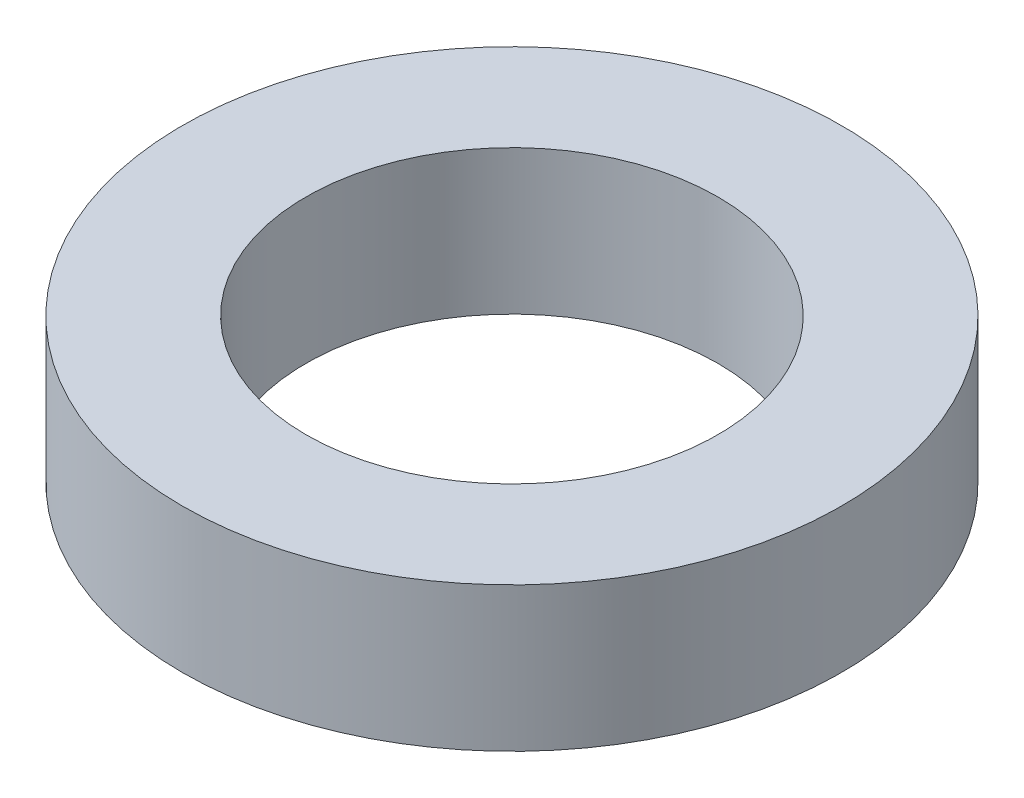
ISO-10303-21;
HEADER;
FILE_DESCRIPTION(('STEP AP214'),'2;1');
FILE_NAME('part.step','',(''),(''),'','','');
FILE_SCHEMA(('AUTOMOTIVE_DESIGN { 1 0 10303 214 1 1 1 1 }'));
ENDSEC;
DATA;
#1=APPLICATION_CONTEXT('core data for automotive mechanical design processes');
#2=APPLICATION_PROTOCOL_DEFINITION('international standard','automotive_design',2000,#1);
#3=PRODUCT_CONTEXT('',#1,'mechanical');
#4=PRODUCT('Part','Part','',(#3));
#5=PRODUCT_RELATED_PRODUCT_CATEGORY('part','',(#4));
#6=PRODUCT_DEFINITION_FORMATION('','',#4);
#7=PRODUCT_DEFINITION_CONTEXT('part definition',#1,'design');
#8=PRODUCT_DEFINITION('design','',#6,#7);
#9=PRODUCT_DEFINITION_SHAPE('','',#8);
#10=(LENGTH_UNIT() NAMED_UNIT(*) SI_UNIT(.MILLI.,.METRE.));
#11=(NAMED_UNIT(*) PLANE_ANGLE_UNIT() SI_UNIT($,.RADIAN.));
#12=(NAMED_UNIT(*) SI_UNIT($,.STERADIAN.) SOLID_ANGLE_UNIT());
#13=UNCERTAINTY_MEASURE_WITH_UNIT(LENGTH_MEASURE(1.E-05),#10,'distance_accuracy_value','');
#14=(GEOMETRIC_REPRESENTATION_CONTEXT(3) GLOBAL_UNCERTAINTY_ASSIGNED_CONTEXT((#13)) GLOBAL_UNIT_ASSIGNED_CONTEXT((#10,
#11,#12)) REPRESENTATION_CONTEXT('',''));
#15=CARTESIAN_POINT('',(0.,0.,0.));
#16=DIRECTION('',(0.,0.,1.));
#17=DIRECTION('',(1.,0.,0.));
#18=AXIS2_PLACEMENT_3D('',#15,#16,#17);
#19=CARTESIAN_POINT('',(0.,7.,0.));
#20=DIRECTION('',(0.,1.,0.));
#21=DIRECTION('',(0.,0.,1.));
#22=AXIS2_PLACEMENT_3D('',#19,#20,#21);
#23=PLANE('',#22);
#24=CARTESIAN_POINT('',(0.,7.,0.));
#25=DIRECTION('',(0.,1.,0.));
#26=DIRECTION('',(0.,0.,1.));
#27=AXIS2_PLACEMENT_3D('',#24,#25,#26);
#28=CIRCLE('',#27,16.);
#29=CARTESIAN_POINT('',(0.,7.,16.));
#30=VERTEX_POINT('',#29);
#31=EDGE_CURVE('E10',#30,#30,#28,.T.);
#32=ORIENTED_EDGE('',*,*,#31,.T.);
#33=EDGE_LOOP('',(#32));
#34=FACE_BOUND('',#33,.T.);
#35=CARTESIAN_POINT('',(0.,7.,0.));
#36=DIRECTION('',(0.,1.,0.));
#37=DIRECTION('',(0.,0.,1.));
#38=AXIS2_PLACEMENT_3D('',#35,#36,#37);
#39=CIRCLE('',#38,10.);
#40=CARTESIAN_POINT('',(0.,7.,10.));
#41=VERTEX_POINT('',#40);
#42=EDGE_CURVE('E50',#41,#41,#39,.T.);
#43=ORIENTED_EDGE('',*,*,#42,.F.);
#44=EDGE_LOOP('',(#43));
#45=FACE_BOUND('',#44,.T.);
#46=ADVANCED_FACE('F37',(#34,#45),#23,.T.);
#47=CARTESIAN_POINT('',(0.,0.,0.));
#48=DIRECTION('',(0.,1.,0.));
#49=DIRECTION('',(0.,0.,1.));
#50=AXIS2_PLACEMENT_3D('',#47,#48,#49);
#51=PLANE('',#50);
#52=CARTESIAN_POINT('',(0.,0.,0.));
#53=DIRECTION('',(0.,1.,0.));
#54=DIRECTION('',(0.,0.,1.));
#55=AXIS2_PLACEMENT_3D('',#52,#53,#54);
#56=CIRCLE('',#55,16.);
#57=CARTESIAN_POINT('',(0.,0.,16.));
#58=VERTEX_POINT('',#57);
#59=EDGE_CURVE('E41',#58,#58,#56,.T.);
#60=ORIENTED_EDGE('',*,*,#59,.F.);
#61=EDGE_LOOP('',(#60));
#62=FACE_BOUND('',#61,.T.);
#63=CARTESIAN_POINT('',(0.,0.,0.));
#64=DIRECTION('',(0.,1.,0.));
#65=DIRECTION('',(0.,0.,1.));
#66=AXIS2_PLACEMENT_3D('',#63,#64,#65);
#67=CIRCLE('',#66,10.);
#68=CARTESIAN_POINT('',(0.,0.,10.));
#69=VERTEX_POINT('',#68);
#70=EDGE_CURVE('E52',#69,#69,#67,.T.);
#71=ORIENTED_EDGE('',*,*,#70,.T.);
#72=EDGE_LOOP('',(#71));
#73=FACE_BOUND('',#72,.T.);
#74=ADVANCED_FACE('F64',(#62,#73),#51,.F.);
#75=CARTESIAN_POINT('',(0.,7.,0.));
#76=DIRECTION('',(0.,-1.,0.));
#77=DIRECTION('',(0.,0.,-1.));
#78=AXIS2_PLACEMENT_3D('',#75,#76,#77);
#79=CYLINDRICAL_SURFACE('',#78,16.);
#80=ORIENTED_EDGE('',*,*,#31,.F.);
#81=EDGE_LOOP('',(#80));
#82=FACE_BOUND('',#81,.T.);
#83=ORIENTED_EDGE('',*,*,#59,.T.);
#84=EDGE_LOOP('',(#83));
#85=FACE_BOUND('',#84,.T.);
#86=ADVANCED_FACE('F39',(#82,#85),#79,.T.);
#87=CARTESIAN_POINT('',(0.,7.,0.));
#88=DIRECTION('',(0.,-1.,0.));
#89=DIRECTION('',(0.,0.,-1.));
#90=AXIS2_PLACEMENT_3D('',#87,#88,#89);
#91=CYLINDRICAL_SURFACE('',#90,10.);
#92=ORIENTED_EDGE('',*,*,#42,.T.);
#93=EDGE_LOOP('',(#92));
#94=FACE_BOUND('',#93,.T.);
#95=ORIENTED_EDGE('',*,*,#70,.F.);
#96=EDGE_LOOP('',(#95));
#97=FACE_BOUND('',#96,.T.);
#98=ADVANCED_FACE('F60',(#94,#97),#91,.F.);
#99=CLOSED_SHELL('',(#46,#74,#86,#98));
#100=MANIFOLD_SOLID_BREP('B2',#99);
#101=ADVANCED_BREP_SHAPE_REPRESENTATION('',(#18,#100),#14);
#102=SHAPE_DEFINITION_REPRESENTATION(#9,#101);
ENDSEC;
END-ISO-10303-21;
